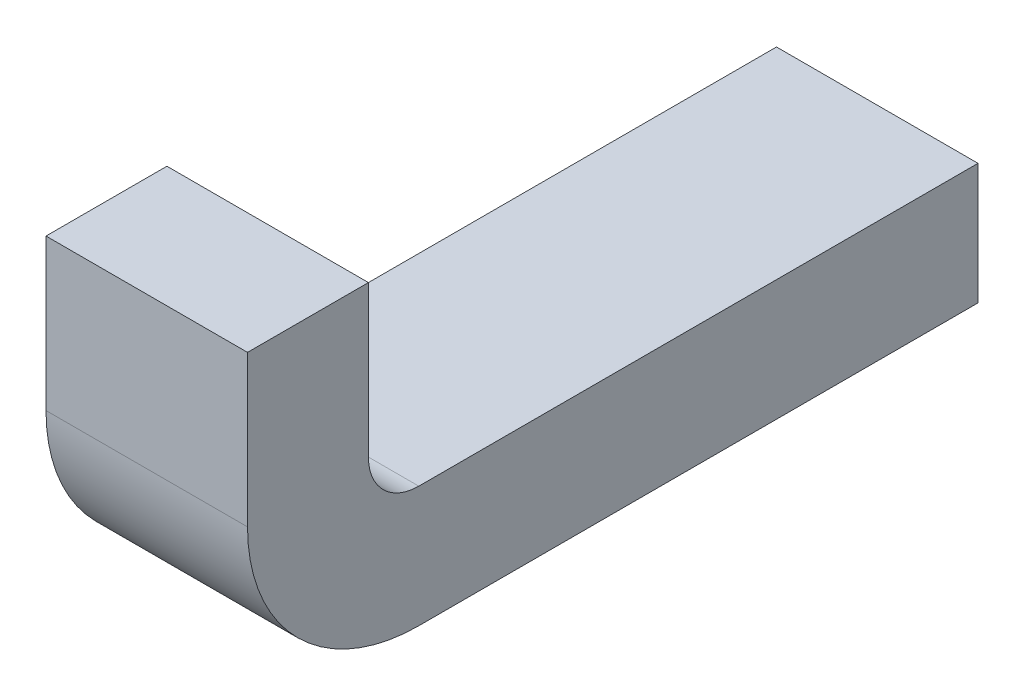
ISO-10303-21;
HEADER;
FILE_DESCRIPTION(('STEP AP214'),'2;1');
FILE_NAME('part.step','',(''),(''),'','','');
FILE_SCHEMA(('AUTOMOTIVE_DESIGN { 1 0 10303 214 1 1 1 1 }'));
ENDSEC;
DATA;
#1=APPLICATION_CONTEXT('core data for automotive mechanical design processes');
#2=APPLICATION_PROTOCOL_DEFINITION('international standard','automotive_design',2000,#1);
#3=PRODUCT_CONTEXT('',#1,'mechanical');
#4=PRODUCT('Part','Part','',(#3));
#5=PRODUCT_RELATED_PRODUCT_CATEGORY('part','',(#4));
#6=PRODUCT_DEFINITION_FORMATION('','',#4);
#7=PRODUCT_DEFINITION_CONTEXT('part definition',#1,'design');
#8=PRODUCT_DEFINITION('design','',#6,#7);
#9=PRODUCT_DEFINITION_SHAPE('','',#8);
#10=(LENGTH_UNIT() NAMED_UNIT(*) SI_UNIT(.MILLI.,.METRE.));
#11=(NAMED_UNIT(*) PLANE_ANGLE_UNIT() SI_UNIT($,.RADIAN.));
#12=(NAMED_UNIT(*) SI_UNIT($,.STERADIAN.) SOLID_ANGLE_UNIT());
#13=UNCERTAINTY_MEASURE_WITH_UNIT(LENGTH_MEASURE(1.E-05),#10,'distance_accuracy_value','');
#14=(GEOMETRIC_REPRESENTATION_CONTEXT(3) GLOBAL_UNCERTAINTY_ASSIGNED_CONTEXT((#13)) GLOBAL_UNIT_ASSIGNED_CONTEXT((#10,
#11,#12)) REPRESENTATION_CONTEXT('',''));
#15=CARTESIAN_POINT('',(0.,0.,0.));
#16=DIRECTION('',(0.,0.,1.));
#17=DIRECTION('',(1.,0.,0.));
#18=AXIS2_PLACEMENT_3D('',#15,#16,#17);
#19=CARTESIAN_POINT('',(-2.65,0.32,-3.130000000002));
#20=DIRECTION('',(0.,0.,1.));
#21=DIRECTION('',(1.,0.,0.));
#22=AXIS2_PLACEMENT_3D('',#19,#20,#21);
#23=PLANE('',#22);
#24=DIRECTION('',(0.,1.,0.));
#25=VECTOR('',#24,1.);
#26=CARTESIAN_POINT('',(-2.625,0.17,-3.130000000002));
#27=LINE('',#26,#25);
#28=CARTESIAN_POINT('',(-2.625,0.17,-3.130000000002));
#29=VERTEX_POINT('',#28);
#30=CARTESIAN_POINT('',(-2.625,0.319999999999995,-3.130000000002));
#31=VERTEX_POINT('',#30);
#32=EDGE_CURVE('E123',#29,#31,#27,.T.);
#33=ORIENTED_EDGE('',*,*,#32,.F.);
#34=DIRECTION('',(1.,0.,0.));
#35=VECTOR('',#34,1.);
#36=CARTESIAN_POINT('',(-2.65,0.17,-3.130000000002));
#37=LINE('',#36,#35);
#38=CARTESIAN_POINT('',(-2.425,0.17,-3.130000000002));
#39=VERTEX_POINT('',#38);
#40=EDGE_CURVE('E64',#39,#29,#37,.F.);
#41=ORIENTED_EDGE('',*,*,#40,.F.);
#42=DIRECTION('',(0.,-1.,0.));
#43=VECTOR('',#42,1.);
#44=CARTESIAN_POINT('',(-2.425,0.,-3.130000000002));
#45=LINE('',#44,#43);
#46=CARTESIAN_POINT('',(-2.425,0.319999999999995,-3.130000000002));
#47=VERTEX_POINT('',#46);
#48=EDGE_CURVE('E70',#39,#47,#45,.F.);
#49=ORIENTED_EDGE('',*,*,#48,.T.);
#50=DIRECTION('',(1.,0.,0.));
#51=VECTOR('',#50,1.);
#52=CARTESIAN_POINT('',(-2.65,0.319999999999985,-3.130000000002));
#53=LINE('',#52,#51);
#54=EDGE_CURVE('E160',#31,#47,#53,.T.);
#55=ORIENTED_EDGE('',*,*,#54,.F.);
#56=EDGE_LOOP('',(#33,#41,#49,#55));
#57=FACE_BOUND('',#56,.T.);
#58=ADVANCED_FACE('F16',(#57),#23,.T.);
#59=CARTESIAN_POINT('',(-2.65,0.32,-3.250000000002));
#60=DIRECTION('',(0.,1.,1.246832498358E-13));
#61=DIRECTION('',(0.,-1.246832498358E-13,1.));
#62=AXIS2_PLACEMENT_3D('',#59,#60,#61);
#63=PLANE('',#62);
#64=DIRECTION('',(0.,0.,1.));
#65=VECTOR('',#64,1.);
#66=CARTESIAN_POINT('',(-2.625,0.32,-3.300000000002));
#67=LINE('',#66,#65);
#68=CARTESIAN_POINT('',(-2.625,0.32,-3.250000000002));
#69=VERTEX_POINT('',#68);
#70=EDGE_CURVE('E101',#31,#69,#67,.F.);
#71=ORIENTED_EDGE('',*,*,#70,.F.);
#72=ORIENTED_EDGE('',*,*,#54,.T.);
#73=DIRECTION('',(0.,0.,1.));
#74=VECTOR('',#73,1.);
#75=CARTESIAN_POINT('',(-2.425,0.32,3.855));
#76=LINE('',#75,#74);
#77=CARTESIAN_POINT('',(-2.425,0.32,-3.250000000002));
#78=VERTEX_POINT('',#77);
#79=EDGE_CURVE('E148',#47,#78,#76,.F.);
#80=ORIENTED_EDGE('',*,*,#79,.T.);
#81=DIRECTION('',(-1.,0.,0.));
#82=VECTOR('',#81,1.);
#83=CARTESIAN_POINT('',(-2.65,0.32,-3.250000000002));
#84=LINE('',#83,#82);
#85=EDGE_CURVE('E155',#69,#78,#84,.F.);
#86=ORIENTED_EDGE('',*,*,#85,.F.);
#87=EDGE_LOOP('',(#71,#72,#80,#86));
#88=FACE_BOUND('',#87,.T.);
#89=ADVANCED_FACE('F179',(#88),#63,.T.);
#90=CARTESIAN_POINT('',(-2.65,0.,-3.300000000002));
#91=DIRECTION('',(0.,-1.,0.));
#92=DIRECTION('',(0.,0.,-1.));
#93=AXIS2_PLACEMENT_3D('',#90,#91,#92);
#94=PLANE('',#93);
#95=DIRECTION('',(0.,0.,1.));
#96=VECTOR('',#95,1.);
#97=CARTESIAN_POINT('',(-2.625,0.,-3.300000000002));
#98=LINE('',#97,#96);
#99=CARTESIAN_POINT('',(-2.625,0.,-3.854999999999));
#100=VERTEX_POINT('',#99);
#101=CARTESIAN_POINT('',(-2.625,0.,-3.300000000002));
#102=VERTEX_POINT('',#101);
#103=EDGE_CURVE('E112',#100,#102,#98,.T.);
#104=ORIENTED_EDGE('',*,*,#103,.F.);
#105=DIRECTION('',(-1.,0.,0.));
#106=VECTOR('',#105,1.);
#107=CARTESIAN_POINT('',(-2.65,0.,-3.854999999999));
#108=LINE('',#107,#106);
#109=CARTESIAN_POINT('',(-2.425,0.,-3.854999999999));
#110=VERTEX_POINT('',#109);
#111=EDGE_CURVE('E125',#110,#100,#108,.T.);
#112=ORIENTED_EDGE('',*,*,#111,.F.);
#113=DIRECTION('',(0.,0.,1.));
#114=VECTOR('',#113,1.);
#115=CARTESIAN_POINT('',(-2.425,0.,3.855));
#116=LINE('',#115,#114);
#117=CARTESIAN_POINT('',(-2.425,0.,-3.300000000002));
#118=VERTEX_POINT('',#117);
#119=EDGE_CURVE('E57',#110,#118,#116,.T.);
#120=ORIENTED_EDGE('',*,*,#119,.T.);
#121=DIRECTION('',(1.,0.,0.));
#122=VECTOR('',#121,1.);
#123=CARTESIAN_POINT('',(-2.65,0.,-3.300000000002));
#124=LINE('',#123,#122);
#125=EDGE_CURVE('E159',#102,#118,#124,.T.);
#126=ORIENTED_EDGE('',*,*,#125,.F.);
#127=EDGE_LOOP('',(#104,#112,#120,#126));
#128=FACE_BOUND('',#127,.T.);
#129=ADVANCED_FACE('F189',(#128),#94,.T.);
#130=CARTESIAN_POINT('',(-2.65,0.17,-3.300000000002));
#131=DIRECTION('',(1.,0.,0.));
#132=DIRECTION('',(0.,0.,-1.));
#133=AXIS2_PLACEMENT_3D('',#130,#131,#132);
#134=CYLINDRICAL_SURFACE('',#133,0.17);
#135=CARTESIAN_POINT('',(-2.625,0.17,-3.300000000002));
#136=DIRECTION('',(1.,0.,0.));
#137=DIRECTION('',(0.,0.,-1.));
#138=AXIS2_PLACEMENT_3D('',#135,#136,#137);
#139=CIRCLE('',#138,0.17);
#140=EDGE_CURVE('E95',#102,#29,#139,.F.);
#141=ORIENTED_EDGE('',*,*,#140,.F.);
#142=ORIENTED_EDGE('',*,*,#125,.T.);
#143=CARTESIAN_POINT('',(-2.425,0.17,-3.300000000002));
#144=DIRECTION('',(1.,0.,0.));
#145=DIRECTION('',(0.,0.,-1.));
#146=AXIS2_PLACEMENT_3D('',#143,#144,#145);
#147=CIRCLE('',#146,0.17);
#148=EDGE_CURVE('E19',#118,#39,#147,.F.);
#149=ORIENTED_EDGE('',*,*,#148,.T.);
#150=ORIENTED_EDGE('',*,*,#40,.T.);
#151=EDGE_LOOP('',(#141,#142,#149,#150));
#152=FACE_BOUND('',#151,.T.);
#153=ADVANCED_FACE('F192',(#152),#134,.T.);
#154=CARTESIAN_POINT('',(-2.65,0.17,-3.250000000002));
#155=DIRECTION('',(0.,0.,-1.));
#156=DIRECTION('',(-1.,0.,0.));
#157=AXIS2_PLACEMENT_3D('',#154,#155,#156);
#158=PLANE('',#157);
#159=DIRECTION('',(0.,1.,0.));
#160=VECTOR('',#159,1.);
#161=CARTESIAN_POINT('',(-2.625,0.17,-3.250000000002));
#162=LINE('',#161,#160);
#163=CARTESIAN_POINT('',(-2.625,0.17,-3.250000000002));
#164=VERTEX_POINT('',#163);
#165=EDGE_CURVE('E91',#69,#164,#162,.F.);
#166=ORIENTED_EDGE('',*,*,#165,.F.);
#167=ORIENTED_EDGE('',*,*,#85,.T.);
#168=DIRECTION('',(0.,-1.,0.));
#169=VECTOR('',#168,1.);
#170=CARTESIAN_POINT('',(-2.425,0.,-3.250000000002));
#171=LINE('',#170,#169);
#172=CARTESIAN_POINT('',(-2.425,0.17,-3.250000000002));
#173=VERTEX_POINT('',#172);
#174=EDGE_CURVE('E85',#78,#173,#171,.T.);
#175=ORIENTED_EDGE('',*,*,#174,.T.);
#176=DIRECTION('',(1.,0.,0.));
#177=VECTOR('',#176,1.);
#178=CARTESIAN_POINT('',(-2.65,0.17,-3.250000000002));
#179=LINE('',#178,#177);
#180=EDGE_CURVE('E89',#173,#164,#179,.F.);
#181=ORIENTED_EDGE('',*,*,#180,.T.);
#182=EDGE_LOOP('',(#166,#167,#175,#181));
#183=FACE_BOUND('',#182,.T.);
#184=ADVANCED_FACE('F90',(#183),#158,.T.);
#185=CARTESIAN_POINT('',(-2.425,0.,3.855));
#186=DIRECTION('',(-1.,0.,0.));
#187=DIRECTION('',(0.,-1.,0.));
#188=AXIS2_PLACEMENT_3D('',#185,#186,#187);
#189=PLANE('',#188);
#190=ORIENTED_EDGE('',*,*,#79,.F.);
#191=ORIENTED_EDGE('',*,*,#48,.F.);
#192=ORIENTED_EDGE('',*,*,#148,.F.);
#193=ORIENTED_EDGE('',*,*,#119,.F.);
#194=DIRECTION('',(0.,1.,0.));
#195=VECTOR('',#194,1.);
#196=CARTESIAN_POINT('',(-2.425,0.,-3.854999999999));
#197=LINE('',#196,#195);
#198=CARTESIAN_POINT('',(-2.425,0.12,-3.854999999999));
#199=VERTEX_POINT('',#198);
#200=EDGE_CURVE('E138',#199,#110,#197,.F.);
#201=ORIENTED_EDGE('',*,*,#200,.F.);
#202=DIRECTION('',(0.,0.,1.));
#203=VECTOR('',#202,1.);
#204=CARTESIAN_POINT('',(-2.425,0.12,-3.854999999999));
#205=LINE('',#204,#203);
#206=CARTESIAN_POINT('',(-2.425,0.12,-3.300000000002));
#207=VERTEX_POINT('',#206);
#208=EDGE_CURVE('E108',#207,#199,#205,.F.);
#209=ORIENTED_EDGE('',*,*,#208,.F.);
#210=CARTESIAN_POINT('',(-2.425,0.17,-3.300000000002));
#211=DIRECTION('',(1.,0.,0.));
#212=DIRECTION('',(0.,0.,-1.));
#213=AXIS2_PLACEMENT_3D('',#210,#211,#212);
#214=CIRCLE('',#213,0.05);
#215=EDGE_CURVE('E106',#207,#173,#214,.F.);
#216=ORIENTED_EDGE('',*,*,#215,.T.);
#217=ORIENTED_EDGE('',*,*,#174,.F.);
#218=EDGE_LOOP('',(#190,#191,#192,#193,#201,#209,#216,#217));
#219=FACE_BOUND('',#218,.T.);
#220=ADVANCED_FACE('F181',(#219),#189,.F.);
#221=CARTESIAN_POINT('',(-2.65,0.,-3.854999999999));
#222=DIRECTION('',(0.,0.,-1.));
#223=DIRECTION('',(-1.,0.,0.));
#224=AXIS2_PLACEMENT_3D('',#221,#222,#223);
#225=PLANE('',#224);
#226=DIRECTION('',(0.,1.,0.));
#227=VECTOR('',#226,1.);
#228=CARTESIAN_POINT('',(-2.625,0.17,-3.854999999999));
#229=LINE('',#228,#227);
#230=CARTESIAN_POINT('',(-2.625,0.12,-3.854999999999));
#231=VERTEX_POINT('',#230);
#232=EDGE_CURVE('E102',#231,#100,#229,.F.);
#233=ORIENTED_EDGE('',*,*,#232,.F.);
#234=DIRECTION('',(1.,0.,0.));
#235=VECTOR('',#234,1.);
#236=CARTESIAN_POINT('',(-2.65,0.12,-3.854999999999));
#237=LINE('',#236,#235);
#238=EDGE_CURVE('E129',#199,#231,#237,.F.);
#239=ORIENTED_EDGE('',*,*,#238,.F.);
#240=ORIENTED_EDGE('',*,*,#200,.T.);
#241=ORIENTED_EDGE('',*,*,#111,.T.);
#242=EDGE_LOOP('',(#233,#239,#240,#241));
#243=FACE_BOUND('',#242,.T.);
#244=ADVANCED_FACE('F188',(#243),#225,.T.);
#245=CARTESIAN_POINT('',(-2.625,0.17,-3.300000000002));
#246=DIRECTION('',(-1.,0.,0.));
#247=DIRECTION('',(0.,0.,1.));
#248=AXIS2_PLACEMENT_3D('',#245,#246,#247);
#249=PLANE('',#248);
#250=ORIENTED_EDGE('',*,*,#103,.T.);
#251=ORIENTED_EDGE('',*,*,#140,.T.);
#252=ORIENTED_EDGE('',*,*,#32,.T.);
#253=ORIENTED_EDGE('',*,*,#70,.T.);
#254=ORIENTED_EDGE('',*,*,#165,.T.);
#255=CARTESIAN_POINT('',(-2.625,0.17,-3.300000000002));
#256=DIRECTION('',(1.,0.,0.));
#257=DIRECTION('',(0.,0.,-1.));
#258=AXIS2_PLACEMENT_3D('',#255,#256,#257);
#259=CIRCLE('',#258,0.05);
#260=CARTESIAN_POINT('',(-2.625,0.12,-3.300000000002));
#261=VERTEX_POINT('',#260);
#262=EDGE_CURVE('E34',#164,#261,#259,.T.);
#263=ORIENTED_EDGE('',*,*,#262,.T.);
#264=DIRECTION('',(0.,0.,1.));
#265=VECTOR('',#264,1.);
#266=CARTESIAN_POINT('',(-2.625,0.12,-3.854999999999));
#267=LINE('',#266,#265);
#268=EDGE_CURVE('E25',#231,#261,#267,.T.);
#269=ORIENTED_EDGE('',*,*,#268,.F.);
#270=ORIENTED_EDGE('',*,*,#232,.T.);
#271=EDGE_LOOP('',(#250,#251,#252,#253,#254,#263,#269,#270));
#272=FACE_BOUND('',#271,.T.);
#273=ADVANCED_FACE('F98',(#272),#249,.T.);
#274=CARTESIAN_POINT('',(-2.65,0.17,-3.300000000002));
#275=DIRECTION('',(1.,0.,0.));
#276=DIRECTION('',(0.,0.,-1.));
#277=AXIS2_PLACEMENT_3D('',#274,#275,#276);
#278=CYLINDRICAL_SURFACE('',#277,0.05);
#279=DIRECTION('',(1.,0.,0.));
#280=VECTOR('',#279,1.);
#281=CARTESIAN_POINT('',(-2.65,0.12,-3.300000000002));
#282=LINE('',#281,#280);
#283=EDGE_CURVE('E11',#261,#207,#282,.T.);
#284=ORIENTED_EDGE('',*,*,#283,.F.);
#285=ORIENTED_EDGE('',*,*,#262,.F.);
#286=ORIENTED_EDGE('',*,*,#180,.F.);
#287=ORIENTED_EDGE('',*,*,#215,.F.);
#288=EDGE_LOOP('',(#284,#285,#286,#287));
#289=FACE_BOUND('',#288,.T.);
#290=ADVANCED_FACE('F104',(#289),#278,.F.);
#291=CARTESIAN_POINT('',(-2.65,0.12,-3.854999999999));
#292=DIRECTION('',(0.,1.,0.));
#293=DIRECTION('',(0.,0.,1.));
#294=AXIS2_PLACEMENT_3D('',#291,#292,#293);
#295=PLANE('',#294);
#296=ORIENTED_EDGE('',*,*,#268,.T.);
#297=ORIENTED_EDGE('',*,*,#283,.T.);
#298=ORIENTED_EDGE('',*,*,#208,.T.);
#299=ORIENTED_EDGE('',*,*,#238,.T.);
#300=EDGE_LOOP('',(#296,#297,#298,#299));
#301=FACE_BOUND('',#300,.T.);
#302=ADVANCED_FACE('F184',(#301),#295,.T.);
#303=CLOSED_SHELL('',(#58,#89,#129,#153,#184,#220,#244,#273,#290,#302));
#304=MANIFOLD_SOLID_BREP('B1',#303);
#305=ADVANCED_BREP_SHAPE_REPRESENTATION('',(#18,#304),#14);
#306=SHAPE_DEFINITION_REPRESENTATION(#9,#305);
ENDSEC;
END-ISO-10303-21;
